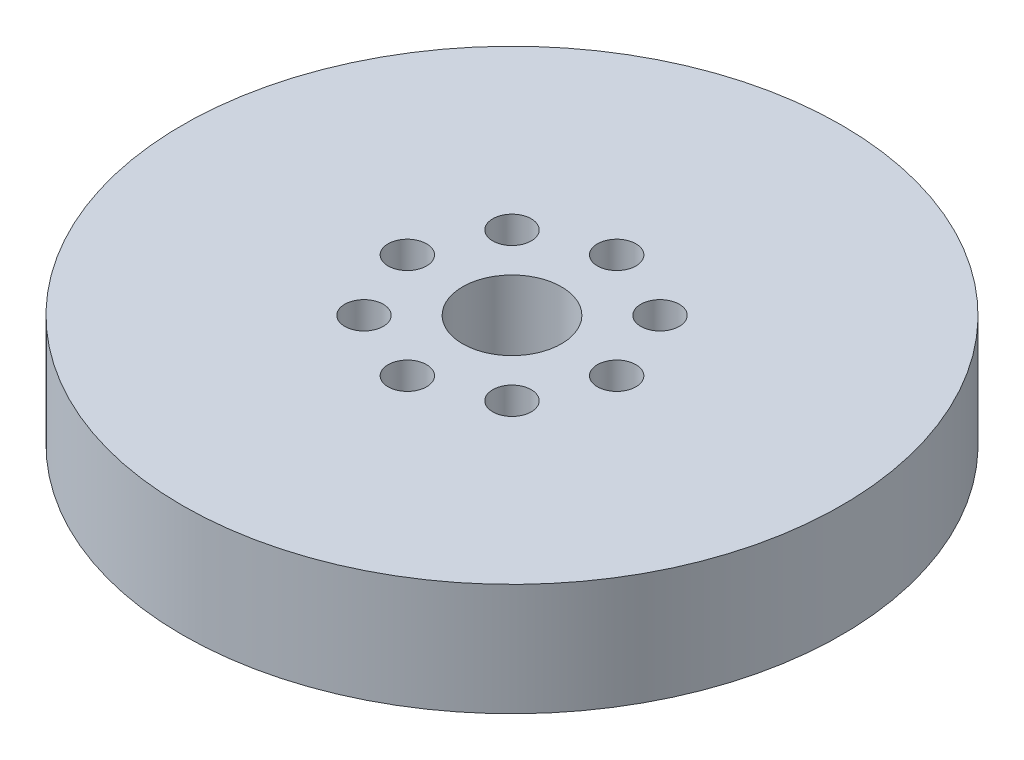
ISO-10303-21;
HEADER;
FILE_DESCRIPTION(('STEP AP214'),'2;1');
FILE_NAME('part.step','',(''),(''),'','','');
FILE_SCHEMA(('AUTOMOTIVE_DESIGN { 1 0 10303 214 1 1 1 1 }'));
ENDSEC;
DATA;
#1=APPLICATION_CONTEXT('core data for automotive mechanical design processes');
#2=APPLICATION_PROTOCOL_DEFINITION('international standard','automotive_design',2000,#1);
#3=PRODUCT_CONTEXT('',#1,'mechanical');
#4=PRODUCT('Part','Part','',(#3));
#5=PRODUCT_RELATED_PRODUCT_CATEGORY('part','',(#4));
#6=PRODUCT_DEFINITION_FORMATION('','',#4);
#7=PRODUCT_DEFINITION_CONTEXT('part definition',#1,'design');
#8=PRODUCT_DEFINITION('design','',#6,#7);
#9=PRODUCT_DEFINITION_SHAPE('','',#8);
#10=(LENGTH_UNIT() NAMED_UNIT(*) SI_UNIT(.MILLI.,.METRE.));
#11=(NAMED_UNIT(*) PLANE_ANGLE_UNIT() SI_UNIT($,.RADIAN.));
#12=(NAMED_UNIT(*) SI_UNIT($,.STERADIAN.) SOLID_ANGLE_UNIT());
#13=UNCERTAINTY_MEASURE_WITH_UNIT(LENGTH_MEASURE(1.E-05),#10,'distance_accuracy_value','');
#14=(GEOMETRIC_REPRESENTATION_CONTEXT(3) GLOBAL_UNCERTAINTY_ASSIGNED_CONTEXT((#13)) GLOBAL_UNIT_ASSIGNED_CONTEXT((#10,
#11,#12)) REPRESENTATION_CONTEXT('',''));
#15=CARTESIAN_POINT('',(0.,0.,0.));
#16=DIRECTION('',(0.,0.,1.));
#17=DIRECTION('',(1.,0.,0.));
#18=AXIS2_PLACEMENT_3D('',#15,#16,#17);
#19=CARTESIAN_POINT('',(0.,17.,0.));
#20=DIRECTION('',(0.,-1.,0.));
#21=DIRECTION('',(0.,0.,-1.));
#22=AXIS2_PLACEMENT_3D('',#19,#20,#21);
#23=CYLINDRICAL_SURFACE('',#22,50.);
#24=CARTESIAN_POINT('',(0.,17.,0.));
#25=DIRECTION('',(0.,1.,0.));
#26=DIRECTION('',(0.,0.,1.));
#27=AXIS2_PLACEMENT_3D('',#24,#25,#26);
#28=CIRCLE('',#27,50.);
#29=CARTESIAN_POINT('',(0.,17.,50.));
#30=VERTEX_POINT('',#29);
#31=EDGE_CURVE('E10',#30,#30,#28,.T.);
#32=ORIENTED_EDGE('',*,*,#31,.F.);
#33=EDGE_LOOP('',(#32));
#34=FACE_BOUND('',#33,.T.);
#35=CARTESIAN_POINT('',(0.,0.,0.));
#36=DIRECTION('',(0.,1.,0.));
#37=DIRECTION('',(0.,0.,1.));
#38=AXIS2_PLACEMENT_3D('',#35,#36,#37);
#39=CIRCLE('',#38,50.);
#40=CARTESIAN_POINT('',(0.,0.,50.));
#41=VERTEX_POINT('',#40);
#42=EDGE_CURVE('E37',#41,#41,#39,.T.);
#43=ORIENTED_EDGE('',*,*,#42,.T.);
#44=EDGE_LOOP('',(#43));
#45=FACE_BOUND('',#44,.T.);
#46=ADVANCED_FACE('F40',(#34,#45),#23,.T.);
#47=CARTESIAN_POINT('',(0.,17.,0.));
#48=DIRECTION('',(0.,1.,0.));
#49=DIRECTION('',(0.,0.,1.));
#50=AXIS2_PLACEMENT_3D('',#47,#48,#49);
#51=PLANE('',#50);
#52=CARTESIAN_POINT('',(0.,17.,15.8799714442098));
#53=DIRECTION('',(0.,1.,0.));
#54=DIRECTION('',(1.,0.,0.));
#55=AXIS2_PLACEMENT_3D('',#52,#53,#54);
#56=CIRCLE('',#55,2.92021263261337);
#57=CARTESIAN_POINT('',(2.92021263261343,17.,15.8799714442098));
#58=VERTEX_POINT('',#57);
#59=EDGE_CURVE('E88',#58,#58,#56,.T.);
#60=ORIENTED_EDGE('',*,*,#59,.F.);
#61=EDGE_LOOP('',(#60));
#62=FACE_BOUND('',#61,.T.);
#63=CARTESIAN_POINT('',(11.2288354932495,17.,11.2288354932494));
#64=DIRECTION('',(0.,1.,0.));
#65=DIRECTION('',(0.707106781186544,0.,-0.707106781186551));
#66=AXIS2_PLACEMENT_3D('',#63,#64,#65);
#67=CIRCLE('',#66,2.92021263261337);
#68=CARTESIAN_POINT('',(13.2937376482771,17.,9.16393333822188));
#69=VERTEX_POINT('',#68);
#70=EDGE_CURVE('E79',#69,#69,#67,.T.);
#71=ORIENTED_EDGE('',*,*,#70,.F.);
#72=EDGE_LOOP('',(#71));
#73=FACE_BOUND('',#72,.T.);
#74=CARTESIAN_POINT('',(15.8799714442098,17.,0.));
#75=DIRECTION('',(0.,1.,0.));
#76=DIRECTION('',(0.,0.,-1.));
#77=AXIS2_PLACEMENT_3D('',#74,#75,#76);
#78=CIRCLE('',#77,2.92021263261337);
#79=CARTESIAN_POINT('',(15.8799714442098,17.,-2.92021263261337));
#80=VERTEX_POINT('',#79);
#81=EDGE_CURVE('E74',#80,#80,#78,.T.);
#82=ORIENTED_EDGE('',*,*,#81,.F.);
#83=EDGE_LOOP('',(#82));
#84=FACE_BOUND('',#83,.T.);
#85=CARTESIAN_POINT('',(11.2288354932494,17.,-11.2288354932496));
#86=DIRECTION('',(0.,1.,0.));
#87=DIRECTION('',(-0.707106781186554,0.,-0.707106781186541));
#88=AXIS2_PLACEMENT_3D('',#85,#86,#87);
#89=CIRCLE('',#88,2.92021263261337);
#90=CARTESIAN_POINT('',(9.16393333822183,17.,-13.2937376482771));
#91=VERTEX_POINT('',#90);
#92=EDGE_CURVE('E70',#91,#91,#89,.T.);
#93=ORIENTED_EDGE('',*,*,#92,.F.);
#94=EDGE_LOOP('',(#93));
#95=FACE_BOUND('',#94,.T.);
#96=CARTESIAN_POINT('',(-1.66333871876461E-13,17.,-15.8799714442098));
#97=DIRECTION('',(0.,1.,0.));
#98=DIRECTION('',(-1.,0.,0.));
#99=AXIS2_PLACEMENT_3D('',#96,#97,#98);
#100=CIRCLE('',#99,2.92021263261337);
#101=CARTESIAN_POINT('',(-2.92021263261354,17.,-15.8799714442098));
#102=VERTEX_POINT('',#101);
#103=EDGE_CURVE('E100',#102,#102,#100,.T.);
#104=ORIENTED_EDGE('',*,*,#103,.F.);
#105=EDGE_LOOP('',(#104));
#106=FACE_BOUND('',#105,.T.);
#107=CARTESIAN_POINT('',(-11.2288354932496,17.,-11.2288354932494));
#108=DIRECTION('',(0.,1.,0.));
#109=DIRECTION('',(-0.707106781186539,0.,0.707106781186556));
#110=AXIS2_PLACEMENT_3D('',#107,#108,#109);
#111=CIRCLE('',#110,2.92021263261337);
#112=CARTESIAN_POINT('',(-13.2937376482771,17.,-9.16393333822179));
#113=VERTEX_POINT('',#112);
#114=EDGE_CURVE('E93',#113,#113,#111,.T.);
#115=ORIENTED_EDGE('',*,*,#114,.F.);
#116=EDGE_LOOP('',(#115));
#117=FACE_BOUND('',#116,.T.);
#118=CARTESIAN_POINT('',(-11.2288354932495,17.,11.2288354932495));
#119=DIRECTION('',(0.,1.,0.));
#120=DIRECTION('',(0.707106781186549,0.,0.707106781186546));
#121=AXIS2_PLACEMENT_3D('',#118,#119,#120);
#122=CIRCLE('',#121,2.92021263261337);
#123=CARTESIAN_POINT('',(-9.16393333822193,17.,13.293737648277));
#124=VERTEX_POINT('',#123);
#125=EDGE_CURVE('E61',#124,#124,#122,.T.);
#126=ORIENTED_EDGE('',*,*,#125,.F.);
#127=EDGE_LOOP('',(#126));
#128=FACE_BOUND('',#127,.T.);
#129=CARTESIAN_POINT('',(-15.8799714442098,17.,0.));
#130=DIRECTION('',(0.,1.,0.));
#131=DIRECTION('',(0.,0.,1.));
#132=AXIS2_PLACEMENT_3D('',#129,#130,#131);
#133=CIRCLE('',#132,2.92021263261337);
#134=CARTESIAN_POINT('',(-15.8799714442098,17.,2.92021263261337));
#135=VERTEX_POINT('',#134);
#136=EDGE_CURVE('E54',#135,#135,#133,.T.);
#137=ORIENTED_EDGE('',*,*,#136,.F.);
#138=EDGE_LOOP('',(#137));
#139=FACE_BOUND('',#138,.T.);
#140=CARTESIAN_POINT('',(0.,17.,0.));
#141=DIRECTION('',(0.,1.,0.));
#142=DIRECTION('',(0.,0.,1.));
#143=AXIS2_PLACEMENT_3D('',#140,#141,#142);
#144=CIRCLE('',#143,7.5);
#145=CARTESIAN_POINT('',(0.,17.,7.5));
#146=VERTEX_POINT('',#145);
#147=EDGE_CURVE('E50',#146,#146,#144,.T.);
#148=ORIENTED_EDGE('',*,*,#147,.F.);
#149=EDGE_LOOP('',(#148));
#150=FACE_BOUND('',#149,.T.);
#151=ORIENTED_EDGE('',*,*,#31,.T.);
#152=EDGE_LOOP('',(#151));
#153=FACE_BOUND('',#152,.T.);
#154=ADVANCED_FACE('F115',(#62,#73,#84,#95,#106,#117,#128,#139,#150,#153),#51,.T.);
#155=CARTESIAN_POINT('',(0.,0.,0.));
#156=DIRECTION('',(0.,1.,0.));
#157=DIRECTION('',(0.,0.,1.));
#158=AXIS2_PLACEMENT_3D('',#155,#156,#157);
#159=PLANE('',#158);
#160=CARTESIAN_POINT('',(0.,0.,0.));
#161=DIRECTION('',(0.,1.,0.));
#162=DIRECTION('',(0.,0.,1.));
#163=AXIS2_PLACEMENT_3D('',#160,#161,#162);
#164=CIRCLE('',#163,7.5);
#165=CARTESIAN_POINT('',(0.,0.,7.5));
#166=VERTEX_POINT('',#165);
#167=EDGE_CURVE('E47',#166,#166,#164,.T.);
#168=ORIENTED_EDGE('',*,*,#167,.T.);
#169=EDGE_LOOP('',(#168));
#170=FACE_BOUND('',#169,.T.);
#171=ORIENTED_EDGE('',*,*,#42,.F.);
#172=EDGE_LOOP('',(#171));
#173=FACE_BOUND('',#172,.T.);
#174=ADVANCED_FACE('F113',(#170,#173),#159,.F.);
#175=CARTESIAN_POINT('',(0.,17.,0.));
#176=DIRECTION('',(0.,-1.,0.));
#177=DIRECTION('',(0.,0.,-1.));
#178=AXIS2_PLACEMENT_3D('',#175,#176,#177);
#179=CYLINDRICAL_SURFACE('',#178,7.5);
#180=ORIENTED_EDGE('',*,*,#147,.T.);
#181=EDGE_LOOP('',(#180));
#182=FACE_BOUND('',#181,.T.);
#183=ORIENTED_EDGE('',*,*,#167,.F.);
#184=EDGE_LOOP('',(#183));
#185=FACE_BOUND('',#184,.T.);
#186=ADVANCED_FACE('F127',(#182,#185),#179,.F.);
#187=CARTESIAN_POINT('',(-15.8799714442098,6.2252056682016,0.));
#188=DIRECTION('',(0.,1.,0.));
#189=DIRECTION('',(0.,0.,1.));
#190=AXIS2_PLACEMENT_3D('',#187,#188,#189);
#191=CYLINDRICAL_SURFACE('',#190,2.92021263261337);
#192=CARTESIAN_POINT('',(-15.8799714442098,6.2252056682016,0.));
#193=DIRECTION('',(0.,1.,0.));
#194=DIRECTION('',(0.,0.,1.));
#195=AXIS2_PLACEMENT_3D('',#192,#193,#194);
#196=CIRCLE('',#195,2.92021263261337);
#197=CARTESIAN_POINT('',(-15.8799714442098,6.2252056682016,2.92021263261337));
#198=VERTEX_POINT('',#197);
#199=EDGE_CURVE('E55',#198,#198,#196,.T.);
#200=ORIENTED_EDGE('',*,*,#199,.F.);
#201=EDGE_LOOP('',(#200));
#202=FACE_BOUND('',#201,.T.);
#203=ORIENTED_EDGE('',*,*,#136,.T.);
#204=EDGE_LOOP('',(#203));
#205=FACE_BOUND('',#204,.T.);
#206=ADVANCED_FACE('F129',(#202,#205),#191,.F.);
#207=CARTESIAN_POINT('',(-15.8799714442098,6.2252056682016,0.));
#208=DIRECTION('',(0.,1.,0.));
#209=DIRECTION('',(0.,0.,1.));
#210=AXIS2_PLACEMENT_3D('',#207,#208,#209);
#211=PLANE('',#210);
#212=ORIENTED_EDGE('',*,*,#199,.T.);
#213=EDGE_LOOP('',(#212));
#214=FACE_BOUND('',#213,.T.);
#215=ADVANCED_FACE('F157',(#214),#211,.T.);
#216=CARTESIAN_POINT('',(-11.2288354932495,6.2252056682016,11.2288354932495));
#217=DIRECTION('',(0.,1.,0.));
#218=DIRECTION('',(0.,0.,1.));
#219=AXIS2_PLACEMENT_3D('',#216,#217,#218);
#220=CYLINDRICAL_SURFACE('',#219,2.92021263261337);
#221=CARTESIAN_POINT('',(-11.2288354932495,6.2252056682016,11.2288354932495));
#222=DIRECTION('',(0.,1.,0.));
#223=DIRECTION('',(0.707106781186549,0.,0.707106781186546));
#224=AXIS2_PLACEMENT_3D('',#221,#222,#223);
#225=CIRCLE('',#224,2.92021263261337);
#226=CARTESIAN_POINT('',(-9.16393333822193,6.2252056682016,13.293737648277));
#227=VERTEX_POINT('',#226);
#228=EDGE_CURVE('E59',#227,#227,#225,.T.);
#229=ORIENTED_EDGE('',*,*,#228,.F.);
#230=EDGE_LOOP('',(#229));
#231=FACE_BOUND('',#230,.T.);
#232=ORIENTED_EDGE('',*,*,#125,.T.);
#233=EDGE_LOOP('',(#232));
#234=FACE_BOUND('',#233,.T.);
#235=ADVANCED_FACE('F170',(#231,#234),#220,.F.);
#236=CARTESIAN_POINT('',(-11.2288354932495,6.2252056682016,11.2288354932495));
#237=DIRECTION('',(0.,1.,0.));
#238=DIRECTION('',(0.707106781186549,0.,0.707106781186546));
#239=AXIS2_PLACEMENT_3D('',#236,#237,#238);
#240=PLANE('',#239);
#241=ORIENTED_EDGE('',*,*,#228,.T.);
#242=EDGE_LOOP('',(#241));
#243=FACE_BOUND('',#242,.T.);
#244=ADVANCED_FACE('F182',(#243),#240,.T.);
#245=CARTESIAN_POINT('',(-11.2288354932496,6.2252056682016,-11.2288354932494));
#246=DIRECTION('',(0.,1.,0.));
#247=DIRECTION('',(0.,0.,1.));
#248=AXIS2_PLACEMENT_3D('',#245,#246,#247);
#249=CYLINDRICAL_SURFACE('',#248,2.92021263261337);
#250=CARTESIAN_POINT('',(-11.2288354932496,6.2252056682016,-11.2288354932494));
#251=DIRECTION('',(0.,1.,0.));
#252=DIRECTION('',(-0.707106781186539,0.,0.707106781186556));
#253=AXIS2_PLACEMENT_3D('',#250,#251,#252);
#254=CIRCLE('',#253,2.92021263261337);
#255=CARTESIAN_POINT('',(-13.2937376482771,6.2252056682016,-9.16393333822179));
#256=VERTEX_POINT('',#255);
#257=EDGE_CURVE('E94',#256,#256,#254,.T.);
#258=ORIENTED_EDGE('',*,*,#257,.F.);
#259=EDGE_LOOP('',(#258));
#260=FACE_BOUND('',#259,.T.);
#261=ORIENTED_EDGE('',*,*,#114,.T.);
#262=EDGE_LOOP('',(#261));
#263=FACE_BOUND('',#262,.T.);
#264=ADVANCED_FACE('F189',(#260,#263),#249,.F.);
#265=CARTESIAN_POINT('',(-11.2288354932496,6.2252056682016,-11.2288354932494));
#266=DIRECTION('',(0.,1.,0.));
#267=DIRECTION('',(-0.707106781186539,0.,0.707106781186556));
#268=AXIS2_PLACEMENT_3D('',#265,#266,#267);
#269=PLANE('',#268);
#270=ORIENTED_EDGE('',*,*,#257,.T.);
#271=EDGE_LOOP('',(#270));
#272=FACE_BOUND('',#271,.T.);
#273=ADVANCED_FACE('F107',(#272),#269,.T.);
#274=CARTESIAN_POINT('',(-1.66333871876461E-13,6.2252056682016,-15.8799714442098));
#275=DIRECTION('',(0.,1.,0.));
#276=DIRECTION('',(0.,0.,1.));
#277=AXIS2_PLACEMENT_3D('',#274,#275,#276);
#278=CYLINDRICAL_SURFACE('',#277,2.92021263261337);
#279=CARTESIAN_POINT('',(-1.66333871876461E-13,6.2252056682016,-15.8799714442098));
#280=DIRECTION('',(0.,1.,0.));
#281=DIRECTION('',(-1.,0.,0.));
#282=AXIS2_PLACEMENT_3D('',#279,#280,#281);
#283=CIRCLE('',#282,2.92021263261337);
#284=CARTESIAN_POINT('',(-2.92021263261354,6.2252056682016,-15.8799714442098));
#285=VERTEX_POINT('',#284);
#286=EDGE_CURVE('E72',#285,#285,#283,.T.);
#287=ORIENTED_EDGE('',*,*,#286,.F.);
#288=EDGE_LOOP('',(#287));
#289=FACE_BOUND('',#288,.T.);
#290=ORIENTED_EDGE('',*,*,#103,.T.);
#291=EDGE_LOOP('',(#290));
#292=FACE_BOUND('',#291,.T.);
#293=ADVANCED_FACE('F104',(#289,#292),#278,.F.);
#294=CARTESIAN_POINT('',(-1.66333871876461E-13,6.2252056682016,-15.8799714442098));
#295=DIRECTION('',(0.,1.,0.));
#296=DIRECTION('',(-1.,0.,0.));
#297=AXIS2_PLACEMENT_3D('',#294,#295,#296);
#298=PLANE('',#297);
#299=ORIENTED_EDGE('',*,*,#286,.T.);
#300=EDGE_LOOP('',(#299));
#301=FACE_BOUND('',#300,.T.);
#302=ADVANCED_FACE('F103',(#301),#298,.T.);
#303=CARTESIAN_POINT('',(11.2288354932494,6.2252056682016,-11.2288354932496));
#304=DIRECTION('',(0.,1.,0.));
#305=DIRECTION('',(0.,0.,1.));
#306=AXIS2_PLACEMENT_3D('',#303,#304,#305);
#307=CYLINDRICAL_SURFACE('',#306,2.92021263261337);
#308=CARTESIAN_POINT('',(11.2288354932494,6.2252056682016,-11.2288354932496));
#309=DIRECTION('',(0.,1.,0.));
#310=DIRECTION('',(-0.707106781186554,0.,-0.707106781186541));
#311=AXIS2_PLACEMENT_3D('',#308,#309,#310);
#312=CIRCLE('',#311,2.92021263261337);
#313=CARTESIAN_POINT('',(9.16393333822183,6.2252056682016,-13.2937376482771));
#314=VERTEX_POINT('',#313);
#315=EDGE_CURVE('E69',#314,#314,#312,.T.);
#316=ORIENTED_EDGE('',*,*,#315,.F.);
#317=EDGE_LOOP('',(#316));
#318=FACE_BOUND('',#317,.T.);
#319=ORIENTED_EDGE('',*,*,#92,.T.);
#320=EDGE_LOOP('',(#319));
#321=FACE_BOUND('',#320,.T.);
#322=ADVANCED_FACE('F219',(#318,#321),#307,.F.);
#323=CARTESIAN_POINT('',(11.2288354932494,6.2252056682016,-11.2288354932496));
#324=DIRECTION('',(0.,1.,0.));
#325=DIRECTION('',(-0.707106781186554,0.,-0.707106781186541));
#326=AXIS2_PLACEMENT_3D('',#323,#324,#325);
#327=PLANE('',#326);
#328=ORIENTED_EDGE('',*,*,#315,.T.);
#329=EDGE_LOOP('',(#328));
#330=FACE_BOUND('',#329,.T.);
#331=ADVANCED_FACE('F227',(#330),#327,.T.);
#332=CARTESIAN_POINT('',(15.8799714442098,6.2252056682016,0.));
#333=DIRECTION('',(0.,1.,0.));
#334=DIRECTION('',(0.,0.,1.));
#335=AXIS2_PLACEMENT_3D('',#332,#333,#334);
#336=CYLINDRICAL_SURFACE('',#335,2.92021263261337);
#337=CARTESIAN_POINT('',(15.8799714442098,6.2252056682016,0.));
#338=DIRECTION('',(0.,1.,0.));
#339=DIRECTION('',(0.,0.,-1.));
#340=AXIS2_PLACEMENT_3D('',#337,#338,#339);
#341=CIRCLE('',#340,2.92021263261337);
#342=CARTESIAN_POINT('',(15.8799714442098,6.2252056682016,-2.92021263261337));
#343=VERTEX_POINT('',#342);
#344=EDGE_CURVE('E80',#343,#343,#341,.T.);
#345=ORIENTED_EDGE('',*,*,#344,.F.);
#346=EDGE_LOOP('',(#345));
#347=FACE_BOUND('',#346,.T.);
#348=ORIENTED_EDGE('',*,*,#81,.T.);
#349=EDGE_LOOP('',(#348));
#350=FACE_BOUND('',#349,.T.);
#351=ADVANCED_FACE('F240',(#347,#350),#336,.F.);
#352=CARTESIAN_POINT('',(15.8799714442098,6.2252056682016,0.));
#353=DIRECTION('',(0.,1.,0.));
#354=DIRECTION('',(0.,0.,-1.));
#355=AXIS2_PLACEMENT_3D('',#352,#353,#354);
#356=PLANE('',#355);
#357=ORIENTED_EDGE('',*,*,#344,.T.);
#358=EDGE_LOOP('',(#357));
#359=FACE_BOUND('',#358,.T.);
#360=ADVANCED_FACE('F246',(#359),#356,.T.);
#361=CARTESIAN_POINT('',(11.2288354932495,6.2252056682016,11.2288354932494));
#362=DIRECTION('',(0.,1.,0.));
#363=DIRECTION('',(0.,0.,1.));
#364=AXIS2_PLACEMENT_3D('',#361,#362,#363);
#365=CYLINDRICAL_SURFACE('',#364,2.92021263261337);
#366=CARTESIAN_POINT('',(11.2288354932495,6.2252056682016,11.2288354932494));
#367=DIRECTION('',(0.,1.,0.));
#368=DIRECTION('',(0.707106781186544,0.,-0.707106781186551));
#369=AXIS2_PLACEMENT_3D('',#366,#367,#368);
#370=CIRCLE('',#369,2.92021263261337);
#371=CARTESIAN_POINT('',(13.2937376482771,6.2252056682016,9.16393333822188));
#372=VERTEX_POINT('',#371);
#373=EDGE_CURVE('E82',#372,#372,#370,.T.);
#374=ORIENTED_EDGE('',*,*,#373,.F.);
#375=EDGE_LOOP('',(#374));
#376=FACE_BOUND('',#375,.T.);
#377=ORIENTED_EDGE('',*,*,#70,.T.);
#378=EDGE_LOOP('',(#377));
#379=FACE_BOUND('',#378,.T.);
#380=ADVANCED_FACE('F254',(#376,#379),#365,.F.);
#381=CARTESIAN_POINT('',(11.2288354932495,6.2252056682016,11.2288354932494));
#382=DIRECTION('',(0.,1.,0.));
#383=DIRECTION('',(0.707106781186544,0.,-0.707106781186551));
#384=AXIS2_PLACEMENT_3D('',#381,#382,#383);
#385=PLANE('',#384);
#386=ORIENTED_EDGE('',*,*,#373,.T.);
#387=EDGE_LOOP('',(#386));
#388=FACE_BOUND('',#387,.T.);
#389=ADVANCED_FACE('F262',(#388),#385,.T.);
#390=CARTESIAN_POINT('',(0.,6.2252056682016,15.8799714442098));
#391=DIRECTION('',(0.,1.,0.));
#392=DIRECTION('',(0.,0.,1.));
#393=AXIS2_PLACEMENT_3D('',#390,#391,#392);
#394=CYLINDRICAL_SURFACE('',#393,2.92021263261337);
#395=CARTESIAN_POINT('',(0.,6.2252056682016,15.8799714442098));
#396=DIRECTION('',(0.,1.,0.));
#397=DIRECTION('',(1.,0.,0.));
#398=AXIS2_PLACEMENT_3D('',#395,#396,#397);
#399=CIRCLE('',#398,2.92021263261337);
#400=CARTESIAN_POINT('',(2.92021263261343,6.2252056682016,15.8799714442098));
#401=VERTEX_POINT('',#400);
#402=EDGE_CURVE('E63',#401,#401,#399,.T.);
#403=ORIENTED_EDGE('',*,*,#402,.F.);
#404=EDGE_LOOP('',(#403));
#405=FACE_BOUND('',#404,.T.);
#406=ORIENTED_EDGE('',*,*,#59,.T.);
#407=EDGE_LOOP('',(#406));
#408=FACE_BOUND('',#407,.T.);
#409=ADVANCED_FACE('F272',(#405,#408),#394,.F.);
#410=CARTESIAN_POINT('',(0.,6.2252056682016,15.8799714442098));
#411=DIRECTION('',(0.,1.,0.));
#412=DIRECTION('',(1.,0.,0.));
#413=AXIS2_PLACEMENT_3D('',#410,#411,#412);
#414=PLANE('',#413);
#415=ORIENTED_EDGE('',*,*,#402,.T.);
#416=EDGE_LOOP('',(#415));
#417=FACE_BOUND('',#416,.T.);
#418=ADVANCED_FACE('F285',(#417),#414,.T.);
#419=CLOSED_SHELL('',(#46,#154,#174,#186,#206,#215,#235,#244,#264,#273,#293,#302,#322,#331,#351,
#360,#380,#389,#409,#418));
#420=MANIFOLD_SOLID_BREP('B2',#419);
#421=ADVANCED_BREP_SHAPE_REPRESENTATION('',(#18,#420),#14);
#422=SHAPE_DEFINITION_REPRESENTATION(#9,#421);
ENDSEC;
END-ISO-10303-21;
